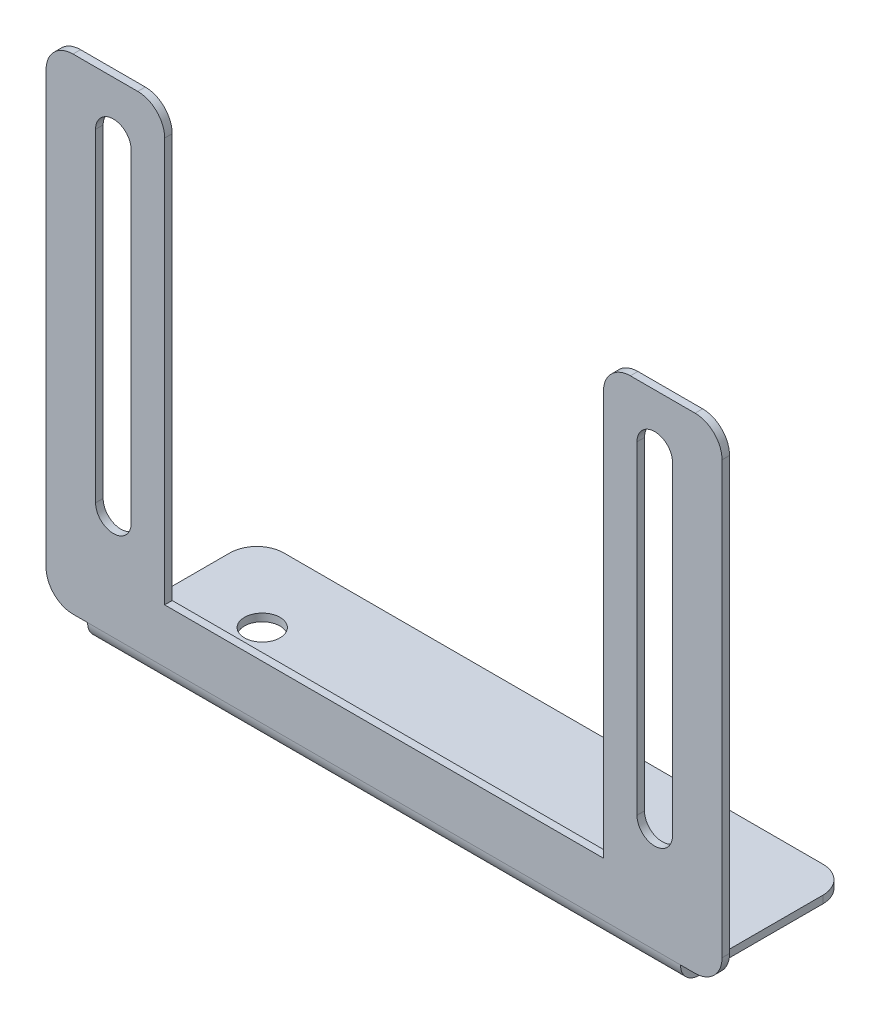
ISO-10303-21;
HEADER;
FILE_DESCRIPTION(('STEP AP214'),'2;1');
FILE_NAME('part.step','',(''),(''),'','','');
FILE_SCHEMA(('AUTOMOTIVE_DESIGN { 1 0 10303 214 1 1 1 1 }'));
ENDSEC;
DATA;
#1=APPLICATION_CONTEXT('core data for automotive mechanical design processes');
#2=APPLICATION_PROTOCOL_DEFINITION('international standard','automotive_design',2000,#1);
#3=PRODUCT_CONTEXT('',#1,'mechanical');
#4=PRODUCT('Part','Part','',(#3));
#5=PRODUCT_RELATED_PRODUCT_CATEGORY('part','',(#4));
#6=PRODUCT_DEFINITION_FORMATION('','',#4);
#7=PRODUCT_DEFINITION_CONTEXT('part definition',#1,'design');
#8=PRODUCT_DEFINITION('design','',#6,#7);
#9=PRODUCT_DEFINITION_SHAPE('','',#8);
#10=(LENGTH_UNIT() NAMED_UNIT(*) SI_UNIT(.MILLI.,.METRE.));
#11=(NAMED_UNIT(*) PLANE_ANGLE_UNIT() SI_UNIT($,.RADIAN.));
#12=(NAMED_UNIT(*) SI_UNIT($,.STERADIAN.) SOLID_ANGLE_UNIT());
#13=UNCERTAINTY_MEASURE_WITH_UNIT(LENGTH_MEASURE(1.E-05),#10,'distance_accuracy_value','');
#14=(GEOMETRIC_REPRESENTATION_CONTEXT(3) GLOBAL_UNCERTAINTY_ASSIGNED_CONTEXT((#13)) GLOBAL_UNIT_ASSIGNED_CONTEXT((#10,
#11,#12)) REPRESENTATION_CONTEXT('',''));
#15=CARTESIAN_POINT('',(0.,0.,0.));
#16=DIRECTION('',(0.,0.,1.));
#17=DIRECTION('',(1.,0.,0.));
#18=AXIS2_PLACEMENT_3D('',#15,#16,#17);
#19=CARTESIAN_POINT('',(-31.35,-22.5,-0.7));
#20=DIRECTION('',(0.,-1.,0.));
#21=DIRECTION('',(0.,0.,-1.));
#22=AXIS2_PLACEMENT_3D('',#19,#20,#21);
#23=PLANE('',#22);
#24=DIRECTION('',(1.,0.,0.));
#25=VECTOR('',#24,1.);
#26=CARTESIAN_POINT('',(-31.35,-22.5,0.));
#27=LINE('',#26,#25);
#28=CARTESIAN_POINT('',(-28.85,-22.5,0.));
#29=VERTEX_POINT('',#28);
#30=CARTESIAN_POINT('',(-27.5,-22.5,0.));
#31=VERTEX_POINT('',#30);
#32=EDGE_CURVE('E407',#29,#31,#27,.T.);
#33=ORIENTED_EDGE('',*,*,#32,.F.);
#34=DIRECTION('',(0.,0.,1.));
#35=VECTOR('',#34,1.);
#36=CARTESIAN_POINT('',(-28.85,-22.5,-0.7));
#37=LINE('',#36,#35);
#38=CARTESIAN_POINT('',(-28.85,-22.5,-0.7));
#39=VERTEX_POINT('',#38);
#40=EDGE_CURVE('E458',#29,#39,#37,.F.);
#41=ORIENTED_EDGE('',*,*,#40,.T.);
#42=DIRECTION('',(1.,0.,0.));
#43=VECTOR('',#42,1.);
#44=CARTESIAN_POINT('',(-31.35,-22.5,-0.7));
#45=LINE('',#44,#43);
#46=CARTESIAN_POINT('',(-27.5,-22.5,-0.699999999999989));
#47=VERTEX_POINT('',#46);
#48=EDGE_CURVE('E428',#39,#47,#45,.T.);
#49=ORIENTED_EDGE('',*,*,#48,.T.);
#50=DIRECTION('',(0.,0.,1.));
#51=VECTOR('',#50,1.);
#52=CARTESIAN_POINT('',(-27.5,-22.5,-0.699999999999989));
#53=LINE('',#52,#51);
#54=EDGE_CURVE('E368',#47,#31,#53,.T.);
#55=ORIENTED_EDGE('',*,*,#54,.T.);
#56=EDGE_LOOP('',(#33,#41,#49,#55));
#57=FACE_BOUND('',#56,.T.);
#58=ADVANCED_FACE('F56',(#57),#23,.T.);
#59=CARTESIAN_POINT('',(31.35,22.5,-0.7));
#60=DIRECTION('',(1.,0.,0.));
#61=DIRECTION('',(0.,0.,-1.));
#62=AXIS2_PLACEMENT_3D('',#59,#60,#61);
#63=PLANE('',#62);
#64=DIRECTION('',(0.,1.,0.));
#65=VECTOR('',#64,1.);
#66=CARTESIAN_POINT('',(31.35,22.5,0.));
#67=LINE('',#66,#65);
#68=CARTESIAN_POINT('',(31.35,-20.,0.));
#69=VERTEX_POINT('',#68);
#70=CARTESIAN_POINT('',(31.35,20.,0.));
#71=VERTEX_POINT('',#70);
#72=EDGE_CURVE('E367',#69,#71,#67,.T.);
#73=ORIENTED_EDGE('',*,*,#72,.F.);
#74=DIRECTION('',(0.,0.,1.));
#75=VECTOR('',#74,1.);
#76=CARTESIAN_POINT('',(31.35,-20.,-0.7));
#77=LINE('',#76,#75);
#78=CARTESIAN_POINT('',(31.35,-20.,-0.7));
#79=VERTEX_POINT('',#78);
#80=EDGE_CURVE('E440',#69,#79,#77,.F.);
#81=ORIENTED_EDGE('',*,*,#80,.T.);
#82=DIRECTION('',(0.,1.,0.));
#83=VECTOR('',#82,1.);
#84=CARTESIAN_POINT('',(31.35,22.5,-0.7));
#85=LINE('',#84,#83);
#86=CARTESIAN_POINT('',(31.35,20.,-0.7));
#87=VERTEX_POINT('',#86);
#88=EDGE_CURVE('E410',#79,#87,#85,.T.);
#89=ORIENTED_EDGE('',*,*,#88,.T.);
#90=DIRECTION('',(0.,0.,1.));
#91=VECTOR('',#90,1.);
#92=CARTESIAN_POINT('',(31.35,20.,-0.7));
#93=LINE('',#92,#91);
#94=EDGE_CURVE('E529',#87,#71,#93,.T.);
#95=ORIENTED_EDGE('',*,*,#94,.T.);
#96=EDGE_LOOP('',(#73,#81,#89,#95));
#97=FACE_BOUND('',#96,.T.);
#98=ADVANCED_FACE('F528',(#97),#63,.T.);
#99=CARTESIAN_POINT('',(27.5,-22.5,-0.699999999999989));
#100=VERTEX_POINT('',#99);
#101=CARTESIAN_POINT('',(28.85,-22.5,-0.7));
#102=VERTEX_POINT('',#101);
#103=EDGE_CURVE('E424',#100,#102,#45,.T.);
#104=ORIENTED_EDGE('',*,*,#103,.T.);
#105=DIRECTION('',(0.,0.,1.));
#106=VECTOR('',#105,1.);
#107=CARTESIAN_POINT('',(28.85,-22.5,-0.7));
#108=LINE('',#107,#106);
#109=CARTESIAN_POINT('',(28.85,-22.5,0.));
#110=VERTEX_POINT('',#109);
#111=EDGE_CURVE('E403',#102,#110,#108,.T.);
#112=ORIENTED_EDGE('',*,*,#111,.T.);
#113=CARTESIAN_POINT('',(27.5,-22.5,0.));
#114=VERTEX_POINT('',#113);
#115=EDGE_CURVE('E411',#114,#110,#27,.T.);
#116=ORIENTED_EDGE('',*,*,#115,.F.);
#117=DIRECTION('',(0.,0.,1.));
#118=VECTOR('',#117,1.);
#119=CARTESIAN_POINT('',(27.5,-22.5,-0.699999999999989));
#120=LINE('',#119,#118);
#121=EDGE_CURVE('E364',#100,#114,#120,.T.);
#122=ORIENTED_EDGE('',*,*,#121,.F.);
#123=EDGE_LOOP('',(#104,#112,#116,#122));
#124=FACE_BOUND('',#123,.T.);
#125=ADVANCED_FACE('F567',(#124),#23,.T.);
#126=CARTESIAN_POINT('',(-31.35,22.5,-0.7));
#127=DIRECTION('',(-1.,0.,0.));
#128=DIRECTION('',(0.,0.,1.));
#129=AXIS2_PLACEMENT_3D('',#126,#127,#128);
#130=PLANE('',#129);
#131=DIRECTION('',(0.,-1.,0.));
#132=VECTOR('',#131,1.);
#133=CARTESIAN_POINT('',(-31.35,22.5,-0.7));
#134=LINE('',#133,#132);
#135=CARTESIAN_POINT('',(-31.35,20.,-0.7));
#136=VERTEX_POINT('',#135);
#137=CARTESIAN_POINT('',(-31.35,-20.,-0.7));
#138=VERTEX_POINT('',#137);
#139=EDGE_CURVE('E429',#136,#138,#134,.T.);
#140=ORIENTED_EDGE('',*,*,#139,.T.);
#141=DIRECTION('',(0.,0.,1.));
#142=VECTOR('',#141,1.);
#143=CARTESIAN_POINT('',(-31.35,-20.,-0.7));
#144=LINE('',#143,#142);
#145=CARTESIAN_POINT('',(-31.35,-20.,0.));
#146=VERTEX_POINT('',#145);
#147=EDGE_CURVE('E455',#138,#146,#144,.T.);
#148=ORIENTED_EDGE('',*,*,#147,.T.);
#149=DIRECTION('',(0.,-1.,0.));
#150=VECTOR('',#149,1.);
#151=CARTESIAN_POINT('',(-31.35,22.5,0.));
#152=LINE('',#151,#150);
#153=CARTESIAN_POINT('',(-31.35,20.,0.));
#154=VERTEX_POINT('',#153);
#155=EDGE_CURVE('E416',#154,#146,#152,.T.);
#156=ORIENTED_EDGE('',*,*,#155,.F.);
#157=DIRECTION('',(0.,0.,1.));
#158=VECTOR('',#157,1.);
#159=CARTESIAN_POINT('',(-31.35,20.,-0.7));
#160=LINE('',#159,#158);
#161=EDGE_CURVE('E453',#154,#136,#160,.F.);
#162=ORIENTED_EDGE('',*,*,#161,.T.);
#163=EDGE_LOOP('',(#140,#148,#156,#162));
#164=FACE_BOUND('',#163,.T.);
#165=ADVANCED_FACE('F498',(#164),#130,.T.);
#166=CARTESIAN_POINT('',(-31.35,22.5,-0.7));
#167=DIRECTION('',(0.,1.,0.));
#168=DIRECTION('',(-1.,0.,0.));
#169=AXIS2_PLACEMENT_3D('',#166,#167,#168);
#170=PLANE('',#169);
#171=DIRECTION('',(-1.,0.,0.));
#172=VECTOR('',#171,1.);
#173=CARTESIAN_POINT('',(-31.35,22.5,-0.7));
#174=LINE('',#173,#172);
#175=CARTESIAN_POINT('',(-22.85,22.5,-0.7));
#176=VERTEX_POINT('',#175);
#177=CARTESIAN_POINT('',(-28.85,22.5,-0.7));
#178=VERTEX_POINT('',#177);
#179=EDGE_CURVE('E509',#176,#178,#174,.T.);
#180=ORIENTED_EDGE('',*,*,#179,.T.);
#181=DIRECTION('',(0.,0.,1.));
#182=VECTOR('',#181,1.);
#183=CARTESIAN_POINT('',(-28.85,22.5,-0.7));
#184=LINE('',#183,#182);
#185=CARTESIAN_POINT('',(-28.85,22.5,0.));
#186=VERTEX_POINT('',#185);
#187=EDGE_CURVE('E462',#178,#186,#184,.T.);
#188=ORIENTED_EDGE('',*,*,#187,.T.);
#189=DIRECTION('',(-1.,0.,0.));
#190=VECTOR('',#189,1.);
#191=CARTESIAN_POINT('',(-31.35,22.5,0.));
#192=LINE('',#191,#190);
#193=CARTESIAN_POINT('',(-22.85,22.5,0.));
#194=VERTEX_POINT('',#193);
#195=EDGE_CURVE('E487',#194,#186,#192,.T.);
#196=ORIENTED_EDGE('',*,*,#195,.F.);
#197=DIRECTION('',(0.,0.,1.));
#198=VECTOR('',#197,1.);
#199=CARTESIAN_POINT('',(-22.85,22.5,-0.7));
#200=LINE('',#199,#198);
#201=EDGE_CURVE('E460',#194,#176,#200,.F.);
#202=ORIENTED_EDGE('',*,*,#201,.T.);
#203=EDGE_LOOP('',(#180,#188,#196,#202));
#204=FACE_BOUND('',#203,.T.);
#205=ADVANCED_FACE('F512',(#204),#170,.T.);
#206=CARTESIAN_POINT('',(-20.35,22.5,-0.7));
#207=DIRECTION('',(1.,0.,0.));
#208=DIRECTION('',(0.,0.,-1.));
#209=AXIS2_PLACEMENT_3D('',#206,#207,#208);
#210=PLANE('',#209);
#211=DIRECTION('',(0.,1.,0.));
#212=VECTOR('',#211,1.);
#213=CARTESIAN_POINT('',(-20.35,22.5,-0.7));
#214=LINE('',#213,#212);
#215=CARTESIAN_POINT('',(-20.35,-17.5,-0.7));
#216=VERTEX_POINT('',#215);
#217=CARTESIAN_POINT('',(-20.35,20.,-0.7));
#218=VERTEX_POINT('',#217);
#219=EDGE_CURVE('E514',#216,#218,#214,.T.);
#220=ORIENTED_EDGE('',*,*,#219,.T.);
#221=DIRECTION('',(0.,0.,1.));
#222=VECTOR('',#221,1.);
#223=CARTESIAN_POINT('',(-20.35,20.,-0.7));
#224=LINE('',#223,#222);
#225=CARTESIAN_POINT('',(-20.35,20.,0.));
#226=VERTEX_POINT('',#225);
#227=EDGE_CURVE('E465',#218,#226,#224,.T.);
#228=ORIENTED_EDGE('',*,*,#227,.T.);
#229=DIRECTION('',(0.,1.,0.));
#230=VECTOR('',#229,1.);
#231=CARTESIAN_POINT('',(-20.35,22.5,0.));
#232=LINE('',#231,#230);
#233=CARTESIAN_POINT('',(-20.35,-17.5,0.));
#234=VERTEX_POINT('',#233);
#235=EDGE_CURVE('E485',#234,#226,#232,.T.);
#236=ORIENTED_EDGE('',*,*,#235,.F.);
#237=DIRECTION('',(0.,0.,1.));
#238=VECTOR('',#237,1.);
#239=CARTESIAN_POINT('',(-20.35,-17.5,-0.7));
#240=LINE('',#239,#238);
#241=EDGE_CURVE('E387',#216,#234,#240,.T.);
#242=ORIENTED_EDGE('',*,*,#241,.F.);
#243=EDGE_LOOP('',(#220,#228,#236,#242));
#244=FACE_BOUND('',#243,.T.);
#245=ADVANCED_FACE('F547',(#244),#210,.T.);
#246=CARTESIAN_POINT('',(-20.35,-17.5,-0.7));
#247=DIRECTION('',(0.,1.,0.));
#248=DIRECTION('',(0.,0.,1.));
#249=AXIS2_PLACEMENT_3D('',#246,#247,#248);
#250=PLANE('',#249);
#251=DIRECTION('',(-1.,0.,0.));
#252=VECTOR('',#251,1.);
#253=CARTESIAN_POINT('',(-20.35,-17.5,0.));
#254=LINE('',#253,#252);
#255=CARTESIAN_POINT('',(20.35,-17.5,0.));
#256=VERTEX_POINT('',#255);
#257=EDGE_CURVE('E480',#256,#234,#254,.T.);
#258=ORIENTED_EDGE('',*,*,#257,.F.);
#259=DIRECTION('',(0.,0.,1.));
#260=VECTOR('',#259,1.);
#261=CARTESIAN_POINT('',(20.35,-17.5,-0.7));
#262=LINE('',#261,#260);
#263=CARTESIAN_POINT('',(20.35,-17.5,-0.7));
#264=VERTEX_POINT('',#263);
#265=EDGE_CURVE('E423',#264,#256,#262,.T.);
#266=ORIENTED_EDGE('',*,*,#265,.F.);
#267=DIRECTION('',(-1.,0.,0.));
#268=VECTOR('',#267,1.);
#269=CARTESIAN_POINT('',(-20.35,-17.5,-0.7));
#270=LINE('',#269,#268);
#271=EDGE_CURVE('E516',#264,#216,#270,.T.);
#272=ORIENTED_EDGE('',*,*,#271,.T.);
#273=ORIENTED_EDGE('',*,*,#241,.T.);
#274=EDGE_LOOP('',(#258,#266,#272,#273));
#275=FACE_BOUND('',#274,.T.);
#276=ADVANCED_FACE('F555',(#275),#250,.T.);
#277=CARTESIAN_POINT('',(20.35,22.5,-0.7));
#278=DIRECTION('',(-1.,0.,0.));
#279=DIRECTION('',(0.,0.,1.));
#280=AXIS2_PLACEMENT_3D('',#277,#278,#279);
#281=PLANE('',#280);
#282=DIRECTION('',(0.,-1.,0.));
#283=VECTOR('',#282,1.);
#284=CARTESIAN_POINT('',(20.35,22.5,0.));
#285=LINE('',#284,#283);
#286=CARTESIAN_POINT('',(20.35,20.,0.));
#287=VERTEX_POINT('',#286);
#288=EDGE_CURVE('E479',#287,#256,#285,.T.);
#289=ORIENTED_EDGE('',*,*,#288,.F.);
#290=DIRECTION('',(0.,0.,1.));
#291=VECTOR('',#290,1.);
#292=CARTESIAN_POINT('',(20.35,20.,-0.7));
#293=LINE('',#292,#291);
#294=CARTESIAN_POINT('',(20.35,20.,-0.7));
#295=VERTEX_POINT('',#294);
#296=EDGE_CURVE('E13',#287,#295,#293,.F.);
#297=ORIENTED_EDGE('',*,*,#296,.T.);
#298=DIRECTION('',(0.,-1.,0.));
#299=VECTOR('',#298,1.);
#300=CARTESIAN_POINT('',(20.35,22.5,-0.7));
#301=LINE('',#300,#299);
#302=EDGE_CURVE('E521',#295,#264,#301,.T.);
#303=ORIENTED_EDGE('',*,*,#302,.T.);
#304=ORIENTED_EDGE('',*,*,#265,.T.);
#305=EDGE_LOOP('',(#289,#297,#303,#304));
#306=FACE_BOUND('',#305,.T.);
#307=ADVANCED_FACE('F553',(#306),#281,.T.);
#308=CARTESIAN_POINT('',(20.35,22.5,-0.7));
#309=DIRECTION('',(0.,1.,0.));
#310=DIRECTION('',(-1.,0.,0.));
#311=AXIS2_PLACEMENT_3D('',#308,#309,#310);
#312=PLANE('',#311);
#313=DIRECTION('',(-1.,0.,0.));
#314=VECTOR('',#313,1.);
#315=CARTESIAN_POINT('',(20.35,22.5,-0.7));
#316=LINE('',#315,#314);
#317=CARTESIAN_POINT('',(28.85,22.5,-0.7));
#318=VERTEX_POINT('',#317);
#319=CARTESIAN_POINT('',(22.85,22.5,-0.7));
#320=VERTEX_POINT('',#319);
#321=EDGE_CURVE('E473',#318,#320,#316,.T.);
#322=ORIENTED_EDGE('',*,*,#321,.T.);
#323=DIRECTION('',(0.,0.,1.));
#324=VECTOR('',#323,1.);
#325=CARTESIAN_POINT('',(22.85,22.5,-0.7));
#326=LINE('',#325,#324);
#327=CARTESIAN_POINT('',(22.85,22.5,0.));
#328=VERTEX_POINT('',#327);
#329=EDGE_CURVE('E64',#320,#328,#326,.T.);
#330=ORIENTED_EDGE('',*,*,#329,.T.);
#331=DIRECTION('',(-1.,0.,0.));
#332=VECTOR('',#331,1.);
#333=CARTESIAN_POINT('',(20.35,22.5,0.));
#334=LINE('',#333,#332);
#335=CARTESIAN_POINT('',(28.85,22.5,0.));
#336=VERTEX_POINT('',#335);
#337=EDGE_CURVE('E472',#336,#328,#334,.T.);
#338=ORIENTED_EDGE('',*,*,#337,.F.);
#339=DIRECTION('',(0.,0.,1.));
#340=VECTOR('',#339,1.);
#341=CARTESIAN_POINT('',(28.85,22.5,-0.7));
#342=LINE('',#341,#340);
#343=EDGE_CURVE('E78',#336,#318,#342,.F.);
#344=ORIENTED_EDGE('',*,*,#343,.T.);
#345=EDGE_LOOP('',(#322,#330,#338,#344));
#346=FACE_BOUND('',#345,.T.);
#347=ADVANCED_FACE('F471',(#346),#312,.T.);
#348=CARTESIAN_POINT('',(0.,0.,-0.7));
#349=DIRECTION('',(0.,0.,1.));
#350=DIRECTION('',(1.,0.,0.));
#351=AXIS2_PLACEMENT_3D('',#348,#349,#350);
#352=PLANE('',#351);
#353=DIRECTION('',(0.,1.,0.));
#354=VECTOR('',#353,1.);
#355=CARTESIAN_POINT('',(26.758,0.,-0.7));
#356=LINE('',#355,#354);
#357=CARTESIAN_POINT('',(26.758,-12.5,-0.699999999999999));
#358=VERTEX_POINT('',#357);
#359=CARTESIAN_POINT('',(26.758,17.5,-0.699999999999999));
#360=VERTEX_POINT('',#359);
#361=EDGE_CURVE('E292',#358,#360,#356,.T.);
#362=ORIENTED_EDGE('',*,*,#361,.T.);
#363=CARTESIAN_POINT('',(25.108,17.5,-0.699999999999999));
#364=DIRECTION('',(0.,0.,1.));
#365=DIRECTION('',(1.,0.,0.));
#366=AXIS2_PLACEMENT_3D('',#363,#364,#365);
#367=CIRCLE('',#366,1.65);
#368=CARTESIAN_POINT('',(23.458,17.5,-0.699999999999999));
#369=VERTEX_POINT('',#368);
#370=EDGE_CURVE('E295',#360,#369,#367,.T.);
#371=ORIENTED_EDGE('',*,*,#370,.T.);
#372=DIRECTION('',(0.,-1.,0.));
#373=VECTOR('',#372,1.);
#374=CARTESIAN_POINT('',(23.458,0.,-0.7));
#375=LINE('',#374,#373);
#376=CARTESIAN_POINT('',(23.458,-12.5,-0.7));
#377=VERTEX_POINT('',#376);
#378=EDGE_CURVE('E287',#369,#377,#375,.T.);
#379=ORIENTED_EDGE('',*,*,#378,.T.);
#380=CARTESIAN_POINT('',(25.108,-12.5,-0.699999999999999));
#381=DIRECTION('',(0.,0.,1.));
#382=DIRECTION('',(1.,0.,0.));
#383=AXIS2_PLACEMENT_3D('',#380,#381,#382);
#384=CIRCLE('',#383,1.65000000000001);
#385=EDGE_CURVE('E262',#377,#358,#384,.T.);
#386=ORIENTED_EDGE('',*,*,#385,.T.);
#387=EDGE_LOOP('',(#362,#371,#379,#386));
#388=FACE_BOUND('',#387,.T.);
#389=DIRECTION('',(0.,1.,0.));
#390=VECTOR('',#389,1.);
#391=CARTESIAN_POINT('',(-23.458,0.,-0.7));
#392=LINE('',#391,#390);
#393=CARTESIAN_POINT('',(-23.458,-12.5,-0.699999999999999));
#394=VERTEX_POINT('',#393);
#395=CARTESIAN_POINT('',(-23.458,17.5,-0.699999999999999));
#396=VERTEX_POINT('',#395);
#397=EDGE_CURVE('E324',#394,#396,#392,.T.);
#398=ORIENTED_EDGE('',*,*,#397,.T.);
#399=CARTESIAN_POINT('',(-25.108,17.5,-0.699999999999999));
#400=DIRECTION('',(0.,0.,1.));
#401=DIRECTION('',(1.,0.,0.));
#402=AXIS2_PLACEMENT_3D('',#399,#400,#401);
#403=CIRCLE('',#402,1.65);
#404=CARTESIAN_POINT('',(-26.758,17.5,-0.699999999999999));
#405=VERTEX_POINT('',#404);
#406=EDGE_CURVE('E327',#396,#405,#403,.T.);
#407=ORIENTED_EDGE('',*,*,#406,.T.);
#408=DIRECTION('',(0.,-1.,0.));
#409=VECTOR('',#408,1.);
#410=CARTESIAN_POINT('',(-26.758,0.,-0.7));
#411=LINE('',#410,#409);
#412=CARTESIAN_POINT('',(-26.758,-12.5,-0.7));
#413=VERTEX_POINT('',#412);
#414=EDGE_CURVE('E312',#405,#413,#411,.T.);
#415=ORIENTED_EDGE('',*,*,#414,.T.);
#416=CARTESIAN_POINT('',(-25.108,-12.5,-0.699999999999999));
#417=DIRECTION('',(0.,0.,1.));
#418=DIRECTION('',(1.,0.,0.));
#419=AXIS2_PLACEMENT_3D('',#416,#417,#418);
#420=CIRCLE('',#419,1.65000000000001);
#421=EDGE_CURVE('E321',#413,#394,#420,.T.);
#422=ORIENTED_EDGE('',*,*,#421,.T.);
#423=EDGE_LOOP('',(#398,#407,#415,#422));
#424=FACE_BOUND('',#423,.T.);
#425=ORIENTED_EDGE('',*,*,#88,.F.);
#426=CARTESIAN_POINT('',(28.85,-20.,-0.7));
#427=DIRECTION('',(0.,0.,1.));
#428=DIRECTION('',(1.,0.,0.));
#429=AXIS2_PLACEMENT_3D('',#426,#427,#428);
#430=CIRCLE('',#429,2.5);
#431=EDGE_CURVE('E451',#79,#102,#430,.F.);
#432=ORIENTED_EDGE('',*,*,#431,.T.);
#433=ORIENTED_EDGE('',*,*,#103,.F.);
#434=DIRECTION('',(-1.,0.,0.));
#435=VECTOR('',#434,1.);
#436=CARTESIAN_POINT('',(-27.5,-22.5,-0.699999999999989));
#437=LINE('',#436,#435);
#438=EDGE_CURVE('E375',#47,#100,#437,.F.);
#439=ORIENTED_EDGE('',*,*,#438,.F.);
#440=ORIENTED_EDGE('',*,*,#48,.F.);
#441=CARTESIAN_POINT('',(-28.85,-20.,-0.7));
#442=DIRECTION('',(0.,0.,1.));
#443=DIRECTION('',(1.,0.,0.));
#444=AXIS2_PLACEMENT_3D('',#441,#442,#443);
#445=CIRCLE('',#444,2.5);
#446=EDGE_CURVE('E449',#39,#138,#445,.F.);
#447=ORIENTED_EDGE('',*,*,#446,.T.);
#448=ORIENTED_EDGE('',*,*,#139,.F.);
#449=CARTESIAN_POINT('',(-28.85,20.,-0.7));
#450=DIRECTION('',(0.,0.,1.));
#451=DIRECTION('',(1.,0.,0.));
#452=AXIS2_PLACEMENT_3D('',#449,#450,#451);
#453=CIRCLE('',#452,2.5);
#454=EDGE_CURVE('E447',#136,#178,#453,.F.);
#455=ORIENTED_EDGE('',*,*,#454,.T.);
#456=ORIENTED_EDGE('',*,*,#179,.F.);
#457=CARTESIAN_POINT('',(-22.85,20.,-0.7));
#458=DIRECTION('',(0.,0.,1.));
#459=DIRECTION('',(1.,0.,0.));
#460=AXIS2_PLACEMENT_3D('',#457,#458,#459);
#461=CIRCLE('',#460,2.5);
#462=EDGE_CURVE('E445',#176,#218,#461,.F.);
#463=ORIENTED_EDGE('',*,*,#462,.T.);
#464=ORIENTED_EDGE('',*,*,#219,.F.);
#465=ORIENTED_EDGE('',*,*,#271,.F.);
#466=ORIENTED_EDGE('',*,*,#302,.F.);
#467=CARTESIAN_POINT('',(22.85,20.,-0.7));
#468=DIRECTION('',(0.,0.,1.));
#469=DIRECTION('',(1.,0.,0.));
#470=AXIS2_PLACEMENT_3D('',#467,#468,#469);
#471=CIRCLE('',#470,2.5);
#472=EDGE_CURVE('E71',#295,#320,#471,.F.);
#473=ORIENTED_EDGE('',*,*,#472,.T.);
#474=ORIENTED_EDGE('',*,*,#321,.F.);
#475=CARTESIAN_POINT('',(28.85,20.,-0.7));
#476=DIRECTION('',(0.,0.,1.));
#477=DIRECTION('',(1.,0.,0.));
#478=AXIS2_PLACEMENT_3D('',#475,#476,#477);
#479=CIRCLE('',#478,2.5);
#480=EDGE_CURVE('E442',#318,#87,#479,.F.);
#481=ORIENTED_EDGE('',*,*,#480,.T.);
#482=EDGE_LOOP('',(#425,#432,#433,#439,#440,#447,#448,#455,#456,#463,#464,#465,#466,#473,#474,#481));
#483=FACE_BOUND('',#482,.T.);
#484=ADVANCED_FACE('F508',(#388,#424,#483),#352,.F.);
#485=CARTESIAN_POINT('',(0.,0.,0.));
#486=DIRECTION('',(0.,0.,1.));
#487=DIRECTION('',(1.,0.,0.));
#488=AXIS2_PLACEMENT_3D('',#485,#486,#487);
#489=PLANE('',#488);
#490=CARTESIAN_POINT('',(25.108,17.5,0.));
#491=DIRECTION('',(0.,0.,1.));
#492=DIRECTION('',(-1.,0.,0.));
#493=AXIS2_PLACEMENT_3D('',#490,#491,#492);
#494=CIRCLE('',#493,1.65);
#495=CARTESIAN_POINT('',(26.758,17.5,0.));
#496=VERTEX_POINT('',#495);
#497=CARTESIAN_POINT('',(23.458,17.5,0.));
#498=VERTEX_POINT('',#497);
#499=EDGE_CURVE('E275',#496,#498,#494,.T.);
#500=ORIENTED_EDGE('',*,*,#499,.F.);
#501=DIRECTION('',(0.,1.,0.));
#502=VECTOR('',#501,1.);
#503=CARTESIAN_POINT('',(26.758,17.5,0.));
#504=LINE('',#503,#502);
#505=CARTESIAN_POINT('',(26.758,-12.5,0.));
#506=VERTEX_POINT('',#505);
#507=EDGE_CURVE('E280',#506,#496,#504,.T.);
#508=ORIENTED_EDGE('',*,*,#507,.F.);
#509=CARTESIAN_POINT('',(25.108,-12.5,0.));
#510=DIRECTION('',(0.,0.,1.));
#511=DIRECTION('',(-1.,0.,0.));
#512=AXIS2_PLACEMENT_3D('',#509,#510,#511);
#513=CIRCLE('',#512,1.65000000000001);
#514=CARTESIAN_POINT('',(23.458,-12.5,0.));
#515=VERTEX_POINT('',#514);
#516=EDGE_CURVE('E259',#515,#506,#513,.T.);
#517=ORIENTED_EDGE('',*,*,#516,.F.);
#518=DIRECTION('',(0.,-1.,0.));
#519=VECTOR('',#518,1.);
#520=CARTESIAN_POINT('',(23.458,17.5,0.));
#521=LINE('',#520,#519);
#522=EDGE_CURVE('E270',#498,#515,#521,.T.);
#523=ORIENTED_EDGE('',*,*,#522,.F.);
#524=EDGE_LOOP('',(#500,#508,#517,#523));
#525=FACE_BOUND('',#524,.T.);
#526=CARTESIAN_POINT('',(-25.108,17.5,0.));
#527=DIRECTION('',(0.,0.,1.));
#528=DIRECTION('',(1.,0.,0.));
#529=AXIS2_PLACEMENT_3D('',#526,#527,#528);
#530=CIRCLE('',#529,1.65);
#531=CARTESIAN_POINT('',(-23.458,17.5,0.));
#532=VERTEX_POINT('',#531);
#533=CARTESIAN_POINT('',(-26.758,17.5,0.));
#534=VERTEX_POINT('',#533);
#535=EDGE_CURVE('E298',#532,#534,#530,.T.);
#536=ORIENTED_EDGE('',*,*,#535,.F.);
#537=DIRECTION('',(0.,1.,0.));
#538=VECTOR('',#537,1.);
#539=CARTESIAN_POINT('',(-23.458,17.5,0.));
#540=LINE('',#539,#538);
#541=CARTESIAN_POINT('',(-23.458,-12.5,0.));
#542=VERTEX_POINT('',#541);
#543=EDGE_CURVE('E306',#542,#532,#540,.T.);
#544=ORIENTED_EDGE('',*,*,#543,.F.);
#545=CARTESIAN_POINT('',(-25.108,-12.5,0.));
#546=DIRECTION('',(0.,0.,1.));
#547=DIRECTION('',(1.,0.,0.));
#548=AXIS2_PLACEMENT_3D('',#545,#546,#547);
#549=CIRCLE('',#548,1.65000000000001);
#550=CARTESIAN_POINT('',(-26.758,-12.5,0.));
#551=VERTEX_POINT('',#550);
#552=EDGE_CURVE('E303',#551,#542,#549,.T.);
#553=ORIENTED_EDGE('',*,*,#552,.F.);
#554=DIRECTION('',(0.,-1.,0.));
#555=VECTOR('',#554,1.);
#556=CARTESIAN_POINT('',(-26.758,17.5,0.));
#557=LINE('',#556,#555);
#558=EDGE_CURVE('E300',#534,#551,#557,.T.);
#559=ORIENTED_EDGE('',*,*,#558,.F.);
#560=EDGE_LOOP('',(#536,#544,#553,#559));
#561=FACE_BOUND('',#560,.T.);
#562=ORIENTED_EDGE('',*,*,#115,.T.);
#563=CARTESIAN_POINT('',(28.85,-20.,0.));
#564=DIRECTION('',(0.,0.,1.));
#565=DIRECTION('',(1.,0.,0.));
#566=AXIS2_PLACEMENT_3D('',#563,#564,#565);
#567=CIRCLE('',#566,2.5);
#568=EDGE_CURVE('E534',#110,#69,#567,.T.);
#569=ORIENTED_EDGE('',*,*,#568,.T.);
#570=ORIENTED_EDGE('',*,*,#72,.T.);
#571=CARTESIAN_POINT('',(28.85,20.,0.));
#572=DIRECTION('',(0.,0.,1.));
#573=DIRECTION('',(1.,0.,0.));
#574=AXIS2_PLACEMENT_3D('',#571,#572,#573);
#575=CIRCLE('',#574,2.5);
#576=EDGE_CURVE('E406',#71,#336,#575,.T.);
#577=ORIENTED_EDGE('',*,*,#576,.T.);
#578=ORIENTED_EDGE('',*,*,#337,.T.);
#579=CARTESIAN_POINT('',(22.85,20.,0.));
#580=DIRECTION('',(0.,0.,1.));
#581=DIRECTION('',(1.,0.,0.));
#582=AXIS2_PLACEMENT_3D('',#579,#580,#581);
#583=CIRCLE('',#582,2.5);
#584=EDGE_CURVE('E476',#328,#287,#583,.T.);
#585=ORIENTED_EDGE('',*,*,#584,.T.);
#586=ORIENTED_EDGE('',*,*,#288,.T.);
#587=ORIENTED_EDGE('',*,*,#257,.T.);
#588=ORIENTED_EDGE('',*,*,#235,.T.);
#589=CARTESIAN_POINT('',(-22.85,20.,0.));
#590=DIRECTION('',(0.,0.,1.));
#591=DIRECTION('',(1.,0.,0.));
#592=AXIS2_PLACEMENT_3D('',#589,#590,#591);
#593=CIRCLE('',#592,2.5);
#594=EDGE_CURVE('E539',#226,#194,#593,.T.);
#595=ORIENTED_EDGE('',*,*,#594,.T.);
#596=ORIENTED_EDGE('',*,*,#195,.T.);
#597=CARTESIAN_POINT('',(-28.85,20.,0.));
#598=DIRECTION('',(0.,0.,1.));
#599=DIRECTION('',(1.,0.,0.));
#600=AXIS2_PLACEMENT_3D('',#597,#598,#599);
#601=CIRCLE('',#600,2.5);
#602=EDGE_CURVE('E494',#186,#154,#601,.T.);
#603=ORIENTED_EDGE('',*,*,#602,.T.);
#604=ORIENTED_EDGE('',*,*,#155,.T.);
#605=CARTESIAN_POINT('',(-28.85,-20.,0.));
#606=DIRECTION('',(0.,0.,1.));
#607=DIRECTION('',(1.,0.,0.));
#608=AXIS2_PLACEMENT_3D('',#605,#606,#607);
#609=CIRCLE('',#608,2.5);
#610=EDGE_CURVE('E492',#146,#29,#609,.T.);
#611=ORIENTED_EDGE('',*,*,#610,.T.);
#612=ORIENTED_EDGE('',*,*,#32,.T.);
#613=DIRECTION('',(-1.,0.,0.));
#614=VECTOR('',#613,1.);
#615=CARTESIAN_POINT('',(-27.5,-22.5,0.));
#616=LINE('',#615,#614);
#617=EDGE_CURVE('E381',#31,#114,#616,.F.);
#618=ORIENTED_EDGE('',*,*,#617,.T.);
#619=EDGE_LOOP('',(#562,#569,#570,#577,#578,#585,#586,#587,#588,#595,#596,#603,#604,#611,#612,#618));
#620=FACE_BOUND('',#619,.T.);
#621=ADVANCED_FACE('F277',(#525,#561,#620),#489,.T.);
#622=CARTESIAN_POINT('',(27.5,-22.5,-1.69999999999999));
#623=DIRECTION('',(1.,0.,0.));
#624=DIRECTION('',(0.,0.,-1.));
#625=AXIS2_PLACEMENT_3D('',#622,#623,#624);
#626=PLANE('',#625);
#627=DIRECTION('',(0.,-1.,0.));
#628=VECTOR('',#627,1.);
#629=CARTESIAN_POINT('',(27.5,-24.2,-1.69999999999998));
#630=LINE('',#629,#628);
#631=CARTESIAN_POINT('',(27.5,-23.5,-1.69999999999999));
#632=VERTEX_POINT('',#631);
#633=CARTESIAN_POINT('',(27.5,-24.2,-1.69999999999998));
#634=VERTEX_POINT('',#633);
#635=EDGE_CURVE('E330',#632,#634,#630,.T.);
#636=ORIENTED_EDGE('',*,*,#635,.F.);
#637=CARTESIAN_POINT('',(27.5,-22.5,-1.69999999999999));
#638=DIRECTION('',(-1.,0.,0.));
#639=DIRECTION('',(0.,0.,1.));
#640=AXIS2_PLACEMENT_3D('',#637,#638,#639);
#641=CIRCLE('',#640,1.);
#642=EDGE_CURVE('E371',#100,#632,#641,.F.);
#643=ORIENTED_EDGE('',*,*,#642,.F.);
#644=ORIENTED_EDGE('',*,*,#121,.T.);
#645=CARTESIAN_POINT('',(27.5,-22.5,-1.69999999999999));
#646=DIRECTION('',(-1.,0.,0.));
#647=DIRECTION('',(0.,0.,1.));
#648=AXIS2_PLACEMENT_3D('',#645,#646,#647);
#649=CIRCLE('',#648,1.7);
#650=EDGE_CURVE('E378',#114,#634,#649,.F.);
#651=ORIENTED_EDGE('',*,*,#650,.T.);
#652=EDGE_LOOP('',(#636,#643,#644,#651));
#653=FACE_BOUND('',#652,.T.);
#654=ADVANCED_FACE('F609',(#653),#626,.T.);
#655=CARTESIAN_POINT('',(-27.5,-22.5,-1.69999999999999));
#656=DIRECTION('',(1.,0.,0.));
#657=DIRECTION('',(0.,0.,-1.));
#658=AXIS2_PLACEMENT_3D('',#655,#656,#657);
#659=PLANE('',#658);
#660=CARTESIAN_POINT('',(-27.5,-22.5,-1.69999999999999));
#661=DIRECTION('',(-1.,0.,0.));
#662=DIRECTION('',(0.,0.,1.));
#663=AXIS2_PLACEMENT_3D('',#660,#661,#662);
#664=CIRCLE('',#663,1.);
#665=CARTESIAN_POINT('',(-27.5,-23.5,-1.69999999999999));
#666=VERTEX_POINT('',#665);
#667=EDGE_CURVE('E333',#666,#47,#664,.T.);
#668=ORIENTED_EDGE('',*,*,#667,.F.);
#669=DIRECTION('',(0.,-1.,0.));
#670=VECTOR('',#669,1.);
#671=CARTESIAN_POINT('',(-27.5,-23.5,-1.69999999999999));
#672=LINE('',#671,#670);
#673=CARTESIAN_POINT('',(-27.5,-24.2,-1.69999999999998));
#674=VERTEX_POINT('',#673);
#675=EDGE_CURVE('E351',#666,#674,#672,.T.);
#676=ORIENTED_EDGE('',*,*,#675,.T.);
#677=CARTESIAN_POINT('',(-27.5,-22.5,-1.69999999999999));
#678=DIRECTION('',(-1.,0.,0.));
#679=DIRECTION('',(0.,0.,1.));
#680=AXIS2_PLACEMENT_3D('',#677,#678,#679);
#681=CIRCLE('',#680,1.7);
#682=EDGE_CURVE('E374',#674,#31,#681,.T.);
#683=ORIENTED_EDGE('',*,*,#682,.T.);
#684=ORIENTED_EDGE('',*,*,#54,.F.);
#685=EDGE_LOOP('',(#668,#676,#683,#684));
#686=FACE_BOUND('',#685,.T.);
#687=ADVANCED_FACE('F630',(#686),#659,.F.);
#688=CARTESIAN_POINT('',(-27.5,-22.5,-1.69999999999999));
#689=DIRECTION('',(-1.,0.,0.));
#690=DIRECTION('',(0.,-1.,0.));
#691=AXIS2_PLACEMENT_3D('',#688,#689,#690);
#692=CYLINDRICAL_SURFACE('',#691,1.7);
#693=ORIENTED_EDGE('',*,*,#617,.F.);
#694=ORIENTED_EDGE('',*,*,#682,.F.);
#695=DIRECTION('',(-1.,0.,0.));
#696=VECTOR('',#695,1.);
#697=CARTESIAN_POINT('',(0.,-24.2,-1.69999999999998));
#698=LINE('',#697,#696);
#699=EDGE_CURVE('E348',#634,#674,#698,.T.);
#700=ORIENTED_EDGE('',*,*,#699,.F.);
#701=ORIENTED_EDGE('',*,*,#650,.F.);
#702=EDGE_LOOP('',(#693,#694,#700,#701));
#703=FACE_BOUND('',#702,.T.);
#704=ADVANCED_FACE('F635',(#703),#692,.T.);
#705=CARTESIAN_POINT('',(-27.5,-22.5,-1.69999999999999));
#706=DIRECTION('',(-1.,0.,0.));
#707=DIRECTION('',(0.,-1.,0.));
#708=AXIS2_PLACEMENT_3D('',#705,#706,#707);
#709=CYLINDRICAL_SURFACE('',#708,1.);
#710=ORIENTED_EDGE('',*,*,#438,.T.);
#711=ORIENTED_EDGE('',*,*,#642,.T.);
#712=DIRECTION('',(1.,0.,0.));
#713=VECTOR('',#712,1.);
#714=CARTESIAN_POINT('',(27.5,-23.5,-1.69999999999999));
#715=LINE('',#714,#713);
#716=EDGE_CURVE('E354',#632,#666,#715,.F.);
#717=ORIENTED_EDGE('',*,*,#716,.T.);
#718=ORIENTED_EDGE('',*,*,#667,.T.);
#719=EDGE_LOOP('',(#710,#711,#717,#718));
#720=FACE_BOUND('',#719,.T.);
#721=ADVANCED_FACE('F604',(#720),#709,.F.);
#722=CARTESIAN_POINT('',(-27.5,-24.2,-0.699999999999987));
#723=DIRECTION('',(-1.,0.,0.));
#724=DIRECTION('',(0.,0.,1.));
#725=AXIS2_PLACEMENT_3D('',#722,#723,#724);
#726=PLANE('',#725);
#727=DIRECTION('',(0.,0.,-1.));
#728=VECTOR('',#727,1.);
#729=CARTESIAN_POINT('',(-27.5,-23.5,0.));
#730=LINE('',#729,#728);
#731=CARTESIAN_POINT('',(-27.5,-23.5,-13.2));
#732=VERTEX_POINT('',#731);
#733=EDGE_CURVE('E340',#732,#666,#730,.F.);
#734=ORIENTED_EDGE('',*,*,#733,.F.);
#735=DIRECTION('',(0.,1.,0.));
#736=VECTOR('',#735,1.);
#737=CARTESIAN_POINT('',(-27.5,-24.2,-13.2));
#738=LINE('',#737,#736);
#739=CARTESIAN_POINT('',(-27.5,-24.2,-13.2));
#740=VERTEX_POINT('',#739);
#741=EDGE_CURVE('E394',#732,#740,#738,.F.);
#742=ORIENTED_EDGE('',*,*,#741,.T.);
#743=DIRECTION('',(0.,0.,1.));
#744=VECTOR('',#743,1.);
#745=CARTESIAN_POINT('',(-27.5,-24.2,-0.699999999999987));
#746=LINE('',#745,#744);
#747=EDGE_CURVE('E331',#740,#674,#746,.T.);
#748=ORIENTED_EDGE('',*,*,#747,.T.);
#749=ORIENTED_EDGE('',*,*,#675,.F.);
#750=EDGE_LOOP('',(#734,#742,#748,#749));
#751=FACE_BOUND('',#750,.T.);
#752=ADVANCED_FACE('F632',(#751),#726,.T.);
#753=CARTESIAN_POINT('',(27.5,-24.2,-15.7));
#754=DIRECTION('',(1.,0.,0.));
#755=DIRECTION('',(0.,0.,-1.));
#756=AXIS2_PLACEMENT_3D('',#753,#754,#755);
#757=PLANE('',#756);
#758=DIRECTION('',(0.,0.,-1.));
#759=VECTOR('',#758,1.);
#760=CARTESIAN_POINT('',(27.5,-24.2,-15.7));
#761=LINE('',#760,#759);
#762=CARTESIAN_POINT('',(27.5,-24.2,-13.2));
#763=VERTEX_POINT('',#762);
#764=EDGE_CURVE('E337',#634,#763,#761,.T.);
#765=ORIENTED_EDGE('',*,*,#764,.T.);
#766=DIRECTION('',(0.,1.,0.));
#767=VECTOR('',#766,1.);
#768=CARTESIAN_POINT('',(27.5,-24.2,-13.2));
#769=LINE('',#768,#767);
#770=CARTESIAN_POINT('',(27.5,-23.5,-13.2));
#771=VERTEX_POINT('',#770);
#772=EDGE_CURVE('E400',#763,#771,#769,.T.);
#773=ORIENTED_EDGE('',*,*,#772,.T.);
#774=DIRECTION('',(0.,0.,1.));
#775=VECTOR('',#774,1.);
#776=CARTESIAN_POINT('',(27.5,-23.5,0.));
#777=LINE('',#776,#775);
#778=EDGE_CURVE('E345',#632,#771,#777,.F.);
#779=ORIENTED_EDGE('',*,*,#778,.F.);
#780=ORIENTED_EDGE('',*,*,#635,.T.);
#781=EDGE_LOOP('',(#765,#773,#779,#780));
#782=FACE_BOUND('',#781,.T.);
#783=ADVANCED_FACE('F613',(#782),#757,.T.);
#784=CARTESIAN_POINT('',(0.,-24.2,0.));
#785=DIRECTION('',(0.,-1.,0.));
#786=DIRECTION('',(0.,0.,-1.));
#787=AXIS2_PLACEMENT_3D('',#784,#785,#786);
#788=PLANE('',#787);
#789=CARTESIAN_POINT('',(20.,-24.2,-8.70000000000002));
#790=DIRECTION('',(0.,-1.,0.));
#791=DIRECTION('',(0.,0.,-1.));
#792=AXIS2_PLACEMENT_3D('',#789,#790,#791);
#793=CIRCLE('',#792,1.65);
#794=CARTESIAN_POINT('',(20.,-24.2,-10.35));
#795=VERTEX_POINT('',#794);
#796=EDGE_CURVE('E1023',#795,#795,#793,.F.);
#797=ORIENTED_EDGE('',*,*,#796,.T.);
#798=EDGE_LOOP('',(#797));
#799=FACE_BOUND('',#798,.T.);
#800=CARTESIAN_POINT('',(-20.,-24.2,-8.70000000000002));
#801=DIRECTION('',(0.,-1.,0.));
#802=DIRECTION('',(0.,0.,-1.));
#803=AXIS2_PLACEMENT_3D('',#800,#801,#802);
#804=CIRCLE('',#803,1.65);
#805=CARTESIAN_POINT('',(-20.,-24.2,-10.35));
#806=VERTEX_POINT('',#805);
#807=EDGE_CURVE('E1018',#806,#806,#804,.F.);
#808=ORIENTED_EDGE('',*,*,#807,.T.);
#809=EDGE_LOOP('',(#808));
#810=FACE_BOUND('',#809,.T.);
#811=ORIENTED_EDGE('',*,*,#747,.F.);
#812=CARTESIAN_POINT('',(-25.,-24.2,-13.2));
#813=DIRECTION('',(0.,-1.,0.));
#814=DIRECTION('',(0.,0.,-1.));
#815=AXIS2_PLACEMENT_3D('',#812,#813,#814);
#816=CIRCLE('',#815,2.5);
#817=CARTESIAN_POINT('',(-25.,-24.2,-15.7));
#818=VERTEX_POINT('',#817);
#819=EDGE_CURVE('E398',#740,#818,#816,.T.);
#820=ORIENTED_EDGE('',*,*,#819,.T.);
#821=DIRECTION('',(-1.,0.,0.));
#822=VECTOR('',#821,1.);
#823=CARTESIAN_POINT('',(-27.5,-24.2,-15.7));
#824=LINE('',#823,#822);
#825=CARTESIAN_POINT('',(25.,-24.2,-15.7));
#826=VERTEX_POINT('',#825);
#827=EDGE_CURVE('E334',#826,#818,#824,.T.);
#828=ORIENTED_EDGE('',*,*,#827,.F.);
#829=CARTESIAN_POINT('',(25.,-24.2,-13.2));
#830=DIRECTION('',(0.,-1.,0.));
#831=DIRECTION('',(0.,0.,-1.));
#832=AXIS2_PLACEMENT_3D('',#829,#830,#831);
#833=CIRCLE('',#832,2.5);
#834=EDGE_CURVE('E396',#826,#763,#833,.T.);
#835=ORIENTED_EDGE('',*,*,#834,.T.);
#836=ORIENTED_EDGE('',*,*,#764,.F.);
#837=ORIENTED_EDGE('',*,*,#699,.T.);
#838=EDGE_LOOP('',(#811,#820,#828,#835,#836,#837));
#839=FACE_BOUND('',#838,.T.);
#840=ADVANCED_FACE('F617',(#799,#810,#839),#788,.T.);
#841=CARTESIAN_POINT('',(0.,-23.5,0.));
#842=DIRECTION('',(0.,-1.,0.));
#843=DIRECTION('',(0.,0.,-1.));
#844=AXIS2_PLACEMENT_3D('',#841,#842,#843);
#845=PLANE('',#844);
#846=CARTESIAN_POINT('',(20.,-23.5,-8.70000000000002));
#847=DIRECTION('',(0.,1.,0.));
#848=DIRECTION('',(0.,0.,-1.));
#849=AXIS2_PLACEMENT_3D('',#846,#847,#848);
#850=CIRCLE('',#849,1.65);
#851=CARTESIAN_POINT('',(20.,-23.5,-10.35));
#852=VERTEX_POINT('',#851);
#853=EDGE_CURVE('E1013',#852,#852,#850,.T.);
#854=ORIENTED_EDGE('',*,*,#853,.F.);
#855=EDGE_LOOP('',(#854));
#856=FACE_BOUND('',#855,.T.);
#857=CARTESIAN_POINT('',(-20.,-23.5,-8.70000000000002));
#858=DIRECTION('',(0.,1.,0.));
#859=DIRECTION('',(0.,0.,1.));
#860=AXIS2_PLACEMENT_3D('',#857,#858,#859);
#861=CIRCLE('',#860,1.65);
#862=CARTESIAN_POINT('',(-20.,-23.5,-7.05000000000002));
#863=VERTEX_POINT('',#862);
#864=EDGE_CURVE('E1016',#863,#863,#861,.T.);
#865=ORIENTED_EDGE('',*,*,#864,.F.);
#866=EDGE_LOOP('',(#865));
#867=FACE_BOUND('',#866,.T.);
#868=DIRECTION('',(1.,0.,0.));
#869=VECTOR('',#868,1.);
#870=CARTESIAN_POINT('',(0.,-23.5,-15.7));
#871=LINE('',#870,#869);
#872=CARTESIAN_POINT('',(25.,-23.5,-15.7));
#873=VERTEX_POINT('',#872);
#874=CARTESIAN_POINT('',(-25.,-23.5,-15.7));
#875=VERTEX_POINT('',#874);
#876=EDGE_CURVE('E342',#873,#875,#871,.F.);
#877=ORIENTED_EDGE('',*,*,#876,.T.);
#878=CARTESIAN_POINT('',(-25.,-23.5,-13.2));
#879=DIRECTION('',(0.,-1.,0.));
#880=DIRECTION('',(0.,0.,-1.));
#881=AXIS2_PLACEMENT_3D('',#878,#879,#880);
#882=CIRCLE('',#881,2.5);
#883=EDGE_CURVE('E392',#875,#732,#882,.F.);
#884=ORIENTED_EDGE('',*,*,#883,.T.);
#885=ORIENTED_EDGE('',*,*,#733,.T.);
#886=ORIENTED_EDGE('',*,*,#716,.F.);
#887=ORIENTED_EDGE('',*,*,#778,.T.);
#888=CARTESIAN_POINT('',(25.,-23.5,-13.2));
#889=DIRECTION('',(0.,-1.,0.));
#890=DIRECTION('',(0.,0.,-1.));
#891=AXIS2_PLACEMENT_3D('',#888,#889,#890);
#892=CIRCLE('',#891,2.5);
#893=EDGE_CURVE('E390',#771,#873,#892,.F.);
#894=ORIENTED_EDGE('',*,*,#893,.T.);
#895=EDGE_LOOP('',(#877,#884,#885,#886,#887,#894));
#896=FACE_BOUND('',#895,.T.);
#897=ADVANCED_FACE('F624',(#856,#867,#896),#845,.F.);
#898=CARTESIAN_POINT('',(-27.5,-24.2,-15.7));
#899=DIRECTION('',(0.,0.,-1.));
#900=DIRECTION('',(0.,1.,0.));
#901=AXIS2_PLACEMENT_3D('',#898,#899,#900);
#902=PLANE('',#901);
#903=ORIENTED_EDGE('',*,*,#827,.T.);
#904=DIRECTION('',(0.,1.,0.));
#905=VECTOR('',#904,1.);
#906=CARTESIAN_POINT('',(-25.,-24.2,-15.7));
#907=LINE('',#906,#905);
#908=EDGE_CURVE('E386',#818,#875,#907,.T.);
#909=ORIENTED_EDGE('',*,*,#908,.T.);
#910=ORIENTED_EDGE('',*,*,#876,.F.);
#911=DIRECTION('',(0.,1.,0.));
#912=VECTOR('',#911,1.);
#913=CARTESIAN_POINT('',(25.,-24.2,-15.7));
#914=LINE('',#913,#912);
#915=EDGE_CURVE('E384',#873,#826,#914,.F.);
#916=ORIENTED_EDGE('',*,*,#915,.T.);
#917=EDGE_LOOP('',(#903,#909,#910,#916));
#918=FACE_BOUND('',#917,.T.);
#919=ADVANCED_FACE('F692',(#918),#902,.T.);
#920=CARTESIAN_POINT('',(-25.108,17.5,-10.));
#921=DIRECTION('',(0.,0.,1.));
#922=DIRECTION('',(1.,0.,0.));
#923=AXIS2_PLACEMENT_3D('',#920,#921,#922);
#924=CYLINDRICAL_SURFACE('',#923,1.65);
#925=DIRECTION('',(0.,0.,1.));
#926=VECTOR('',#925,1.);
#927=CARTESIAN_POINT('',(-23.458,17.5,-10.));
#928=LINE('',#927,#926);
#929=EDGE_CURVE('E310',#396,#532,#928,.T.);
#930=ORIENTED_EDGE('',*,*,#929,.T.);
#931=ORIENTED_EDGE('',*,*,#535,.T.);
#932=DIRECTION('',(0.,0.,1.));
#933=VECTOR('',#932,1.);
#934=CARTESIAN_POINT('',(-26.758,17.5,-10.));
#935=LINE('',#934,#933);
#936=EDGE_CURVE('E309',#405,#534,#935,.T.);
#937=ORIENTED_EDGE('',*,*,#936,.F.);
#938=ORIENTED_EDGE('',*,*,#406,.F.);
#939=EDGE_LOOP('',(#930,#931,#937,#938));
#940=FACE_BOUND('',#939,.T.);
#941=ADVANCED_FACE('F686',(#940),#924,.F.);
#942=CARTESIAN_POINT('',(-23.458,17.5,-10.));
#943=DIRECTION('',(1.,0.,0.));
#944=DIRECTION('',(0.,1.,0.));
#945=AXIS2_PLACEMENT_3D('',#942,#943,#944);
#946=PLANE('',#945);
#947=DIRECTION('',(0.,0.,1.));
#948=VECTOR('',#947,1.);
#949=CARTESIAN_POINT('',(-23.458,-12.5,-10.));
#950=LINE('',#949,#948);
#951=EDGE_CURVE('E313',#394,#542,#950,.T.);
#952=ORIENTED_EDGE('',*,*,#951,.T.);
#953=ORIENTED_EDGE('',*,*,#543,.T.);
#954=ORIENTED_EDGE('',*,*,#929,.F.);
#955=ORIENTED_EDGE('',*,*,#397,.F.);
#956=EDGE_LOOP('',(#952,#953,#954,#955));
#957=FACE_BOUND('',#956,.T.);
#958=ADVANCED_FACE('F691',(#957),#946,.F.);
#959=CARTESIAN_POINT('',(-25.108,-12.5,-10.));
#960=DIRECTION('',(0.,0.,1.));
#961=DIRECTION('',(1.,0.,0.));
#962=AXIS2_PLACEMENT_3D('',#959,#960,#961);
#963=CYLINDRICAL_SURFACE('',#962,1.65000000000001);
#964=DIRECTION('',(0.,0.,1.));
#965=VECTOR('',#964,1.);
#966=CARTESIAN_POINT('',(-26.758,-12.5,-10.));
#967=LINE('',#966,#965);
#968=EDGE_CURVE('E315',#413,#551,#967,.T.);
#969=ORIENTED_EDGE('',*,*,#968,.T.);
#970=ORIENTED_EDGE('',*,*,#552,.T.);
#971=ORIENTED_EDGE('',*,*,#951,.F.);
#972=ORIENTED_EDGE('',*,*,#421,.F.);
#973=EDGE_LOOP('',(#969,#970,#971,#972));
#974=FACE_BOUND('',#973,.T.);
#975=ADVANCED_FACE('F705',(#974),#963,.F.);
#976=CARTESIAN_POINT('',(-26.758,17.5,-10.));
#977=DIRECTION('',(-1.,0.,0.));
#978=DIRECTION('',(0.,0.,1.));
#979=AXIS2_PLACEMENT_3D('',#976,#977,#978);
#980=PLANE('',#979);
#981=ORIENTED_EDGE('',*,*,#936,.T.);
#982=ORIENTED_EDGE('',*,*,#558,.T.);
#983=ORIENTED_EDGE('',*,*,#968,.F.);
#984=ORIENTED_EDGE('',*,*,#414,.F.);
#985=EDGE_LOOP('',(#981,#982,#983,#984));
#986=FACE_BOUND('',#985,.T.);
#987=ADVANCED_FACE('F716',(#986),#980,.F.);
#988=CARTESIAN_POINT('',(25.108,17.5,-10.));
#989=DIRECTION('',(0.,0.,1.));
#990=DIRECTION('',(1.,0.,0.));
#991=AXIS2_PLACEMENT_3D('',#988,#989,#990);
#992=CYLINDRICAL_SURFACE('',#991,1.65);
#993=DIRECTION('',(0.,0.,1.));
#994=VECTOR('',#993,1.);
#995=CARTESIAN_POINT('',(26.758,17.5,-10.));
#996=LINE('',#995,#994);
#997=EDGE_CURVE('E285',#360,#496,#996,.T.);
#998=ORIENTED_EDGE('',*,*,#997,.T.);
#999=ORIENTED_EDGE('',*,*,#499,.T.);
#1000=DIRECTION('',(0.,0.,1.));
#1001=VECTOR('',#1000,1.);
#1002=CARTESIAN_POINT('',(23.458,17.5,-10.));
#1003=LINE('',#1002,#1001);
#1004=EDGE_CURVE('E266',#369,#498,#1003,.T.);
#1005=ORIENTED_EDGE('',*,*,#1004,.F.);
#1006=ORIENTED_EDGE('',*,*,#370,.F.);
#1007=EDGE_LOOP('',(#998,#999,#1005,#1006));
#1008=FACE_BOUND('',#1007,.T.);
#1009=ADVANCED_FACE('F727',(#1008),#992,.F.);
#1010=CARTESIAN_POINT('',(26.758,17.5,-10.));
#1011=DIRECTION('',(1.,0.,0.));
#1012=DIRECTION('',(0.,1.,0.));
#1013=AXIS2_PLACEMENT_3D('',#1010,#1011,#1012);
#1014=PLANE('',#1013);
#1015=DIRECTION('',(0.,0.,1.));
#1016=VECTOR('',#1015,1.);
#1017=CARTESIAN_POINT('',(26.758,-12.5,-10.));
#1018=LINE('',#1017,#1016);
#1019=EDGE_CURVE('E265',#358,#506,#1018,.T.);
#1020=ORIENTED_EDGE('',*,*,#1019,.T.);
#1021=ORIENTED_EDGE('',*,*,#507,.T.);
#1022=ORIENTED_EDGE('',*,*,#997,.F.);
#1023=ORIENTED_EDGE('',*,*,#361,.F.);
#1024=EDGE_LOOP('',(#1020,#1021,#1022,#1023));
#1025=FACE_BOUND('',#1024,.T.);
#1026=ADVANCED_FACE('F738',(#1025),#1014,.F.);
#1027=CARTESIAN_POINT('',(25.108,-12.5,-10.));
#1028=DIRECTION('',(0.,0.,1.));
#1029=DIRECTION('',(1.,0.,0.));
#1030=AXIS2_PLACEMENT_3D('',#1027,#1028,#1029);
#1031=CYLINDRICAL_SURFACE('',#1030,1.65000000000001);
#1032=DIRECTION('',(0.,0.,1.));
#1033=VECTOR('',#1032,1.);
#1034=CARTESIAN_POINT('',(23.458,-12.5,-10.));
#1035=LINE('',#1034,#1033);
#1036=EDGE_CURVE('E254',#377,#515,#1035,.T.);
#1037=ORIENTED_EDGE('',*,*,#1036,.T.);
#1038=ORIENTED_EDGE('',*,*,#516,.T.);
#1039=ORIENTED_EDGE('',*,*,#1019,.F.);
#1040=ORIENTED_EDGE('',*,*,#385,.F.);
#1041=EDGE_LOOP('',(#1037,#1038,#1039,#1040));
#1042=FACE_BOUND('',#1041,.T.);
#1043=ADVANCED_FACE('F256',(#1042),#1031,.F.);
#1044=CARTESIAN_POINT('',(23.458,17.5,-10.));
#1045=DIRECTION('',(-1.,0.,0.));
#1046=DIRECTION('',(0.,-1.,0.));
#1047=AXIS2_PLACEMENT_3D('',#1044,#1045,#1046);
#1048=PLANE('',#1047);
#1049=ORIENTED_EDGE('',*,*,#1004,.T.);
#1050=ORIENTED_EDGE('',*,*,#522,.T.);
#1051=ORIENTED_EDGE('',*,*,#1036,.F.);
#1052=ORIENTED_EDGE('',*,*,#378,.F.);
#1053=EDGE_LOOP('',(#1049,#1050,#1051,#1052));
#1054=FACE_BOUND('',#1053,.T.);
#1055=ADVANCED_FACE('F271',(#1054),#1048,.F.);
#1056=CARTESIAN_POINT('',(-20.,-24.201025,-8.70000000000002));
#1057=DIRECTION('',(0.,1.,0.));
#1058=DIRECTION('',(0.,0.,1.));
#1059=AXIS2_PLACEMENT_3D('',#1056,#1057,#1058);
#1060=CYLINDRICAL_SURFACE('',#1059,1.65);
#1061=ORIENTED_EDGE('',*,*,#807,.F.);
#1062=EDGE_LOOP('',(#1061));
#1063=FACE_BOUND('',#1062,.T.);
#1064=ORIENTED_EDGE('',*,*,#864,.T.);
#1065=EDGE_LOOP('',(#1064));
#1066=FACE_BOUND('',#1065,.T.);
#1067=ADVANCED_FACE('F768',(#1063,#1066),#1060,.F.);
#1068=CARTESIAN_POINT('',(20.,-24.201025,-8.70000000000002));
#1069=DIRECTION('',(0.,1.,0.));
#1070=DIRECTION('',(0.,0.,1.));
#1071=AXIS2_PLACEMENT_3D('',#1068,#1069,#1070);
#1072=CYLINDRICAL_SURFACE('',#1071,1.65);
#1073=ORIENTED_EDGE('',*,*,#796,.F.);
#1074=EDGE_LOOP('',(#1073));
#1075=FACE_BOUND('',#1074,.T.);
#1076=ORIENTED_EDGE('',*,*,#853,.T.);
#1077=EDGE_LOOP('',(#1076));
#1078=FACE_BOUND('',#1077,.T.);
#1079=ADVANCED_FACE('F778',(#1075,#1078),#1072,.F.);
#1080=CARTESIAN_POINT('',(-25.,-24.2,-13.2));
#1081=DIRECTION('',(0.,1.,0.));
#1082=DIRECTION('',(0.,0.,1.));
#1083=AXIS2_PLACEMENT_3D('',#1080,#1081,#1082);
#1084=CYLINDRICAL_SURFACE('',#1083,2.5);
#1085=ORIENTED_EDGE('',*,*,#819,.F.);
#1086=ORIENTED_EDGE('',*,*,#741,.F.);
#1087=ORIENTED_EDGE('',*,*,#883,.F.);
#1088=ORIENTED_EDGE('',*,*,#908,.F.);
#1089=EDGE_LOOP('',(#1085,#1086,#1087,#1088));
#1090=FACE_BOUND('',#1089,.T.);
#1091=ADVANCED_FACE('F788',(#1090),#1084,.T.);
#1092=CARTESIAN_POINT('',(25.,-24.2,-13.2));
#1093=DIRECTION('',(0.,1.,0.));
#1094=DIRECTION('',(0.,0.,1.));
#1095=AXIS2_PLACEMENT_3D('',#1092,#1093,#1094);
#1096=CYLINDRICAL_SURFACE('',#1095,2.5);
#1097=ORIENTED_EDGE('',*,*,#834,.F.);
#1098=ORIENTED_EDGE('',*,*,#915,.F.);
#1099=ORIENTED_EDGE('',*,*,#893,.F.);
#1100=ORIENTED_EDGE('',*,*,#772,.F.);
#1101=EDGE_LOOP('',(#1097,#1098,#1099,#1100));
#1102=FACE_BOUND('',#1101,.T.);
#1103=ADVANCED_FACE('F622',(#1102),#1096,.T.);
#1104=CARTESIAN_POINT('',(28.85,-20.,-0.7));
#1105=DIRECTION('',(0.,0.,1.));
#1106=DIRECTION('',(1.,0.,0.));
#1107=AXIS2_PLACEMENT_3D('',#1104,#1105,#1106);
#1108=CYLINDRICAL_SURFACE('',#1107,2.5);
#1109=ORIENTED_EDGE('',*,*,#431,.F.);
#1110=ORIENTED_EDGE('',*,*,#80,.F.);
#1111=ORIENTED_EDGE('',*,*,#568,.F.);
#1112=ORIENTED_EDGE('',*,*,#111,.F.);
#1113=EDGE_LOOP('',(#1109,#1110,#1111,#1112));
#1114=FACE_BOUND('',#1113,.T.);
#1115=ADVANCED_FACE('F585',(#1114),#1108,.T.);
#1116=CARTESIAN_POINT('',(-28.85,-20.,-0.7));
#1117=DIRECTION('',(0.,0.,1.));
#1118=DIRECTION('',(1.,0.,0.));
#1119=AXIS2_PLACEMENT_3D('',#1116,#1117,#1118);
#1120=CYLINDRICAL_SURFACE('',#1119,2.5);
#1121=ORIENTED_EDGE('',*,*,#446,.F.);
#1122=ORIENTED_EDGE('',*,*,#40,.F.);
#1123=ORIENTED_EDGE('',*,*,#610,.F.);
#1124=ORIENTED_EDGE('',*,*,#147,.F.);
#1125=EDGE_LOOP('',(#1121,#1122,#1123,#1124));
#1126=FACE_BOUND('',#1125,.T.);
#1127=ADVANCED_FACE('F937',(#1126),#1120,.T.);
#1128=CARTESIAN_POINT('',(-28.85,20.,-0.7));
#1129=DIRECTION('',(0.,0.,1.));
#1130=DIRECTION('',(1.,0.,0.));
#1131=AXIS2_PLACEMENT_3D('',#1128,#1129,#1130);
#1132=CYLINDRICAL_SURFACE('',#1131,2.5);
#1133=ORIENTED_EDGE('',*,*,#454,.F.);
#1134=ORIENTED_EDGE('',*,*,#161,.F.);
#1135=ORIENTED_EDGE('',*,*,#602,.F.);
#1136=ORIENTED_EDGE('',*,*,#187,.F.);
#1137=EDGE_LOOP('',(#1133,#1134,#1135,#1136));
#1138=FACE_BOUND('',#1137,.T.);
#1139=ADVANCED_FACE('F503',(#1138),#1132,.T.);
#1140=CARTESIAN_POINT('',(-22.85,20.,-0.7));
#1141=DIRECTION('',(0.,0.,1.));
#1142=DIRECTION('',(1.,0.,0.));
#1143=AXIS2_PLACEMENT_3D('',#1140,#1141,#1142);
#1144=CYLINDRICAL_SURFACE('',#1143,2.5);
#1145=ORIENTED_EDGE('',*,*,#462,.F.);
#1146=ORIENTED_EDGE('',*,*,#201,.F.);
#1147=ORIENTED_EDGE('',*,*,#594,.F.);
#1148=ORIENTED_EDGE('',*,*,#227,.F.);
#1149=EDGE_LOOP('',(#1145,#1146,#1147,#1148));
#1150=FACE_BOUND('',#1149,.T.);
#1151=ADVANCED_FACE('F543',(#1150),#1144,.T.);
#1152=CARTESIAN_POINT('',(22.85,20.,-0.7));
#1153=DIRECTION('',(0.,0.,1.));
#1154=DIRECTION('',(1.,0.,0.));
#1155=AXIS2_PLACEMENT_3D('',#1152,#1153,#1154);
#1156=CYLINDRICAL_SURFACE('',#1155,2.5);
#1157=ORIENTED_EDGE('',*,*,#472,.F.);
#1158=ORIENTED_EDGE('',*,*,#296,.F.);
#1159=ORIENTED_EDGE('',*,*,#584,.F.);
#1160=ORIENTED_EDGE('',*,*,#329,.F.);
#1161=EDGE_LOOP('',(#1157,#1158,#1159,#1160));
#1162=FACE_BOUND('',#1161,.T.);
#1163=ADVANCED_FACE('F963',(#1162),#1156,.T.);
#1164=CARTESIAN_POINT('',(28.85,20.,-0.7));
#1165=DIRECTION('',(0.,0.,1.));
#1166=DIRECTION('',(1.,0.,0.));
#1167=AXIS2_PLACEMENT_3D('',#1164,#1165,#1166);
#1168=CYLINDRICAL_SURFACE('',#1167,2.5);
#1169=ORIENTED_EDGE('',*,*,#480,.F.);
#1170=ORIENTED_EDGE('',*,*,#343,.F.);
#1171=ORIENTED_EDGE('',*,*,#576,.F.);
#1172=ORIENTED_EDGE('',*,*,#94,.F.);
#1173=EDGE_LOOP('',(#1169,#1170,#1171,#1172));
#1174=FACE_BOUND('',#1173,.T.);
#1175=ADVANCED_FACE('F58',(#1174),#1168,.T.);
#1176=CLOSED_SHELL('',(#58,#98,#125,#165,#205,#245,#276,#307,#347,#484,#621,#654,#687,#704,#721,
#752,#783,#840,#897,#919,#941,#958,#975,#987,#1009,#1026,#1043,#1055,#1067,#1079,#1091,#1103,
#1115,#1127,#1139,#1151,#1163,#1175));
#1177=MANIFOLD_SOLID_BREP('B2',#1176);
#1178=ADVANCED_BREP_SHAPE_REPRESENTATION('',(#18,#1177),#14);
#1179=SHAPE_DEFINITION_REPRESENTATION(#9,#1178);
ENDSEC;
END-ISO-10303-21;
